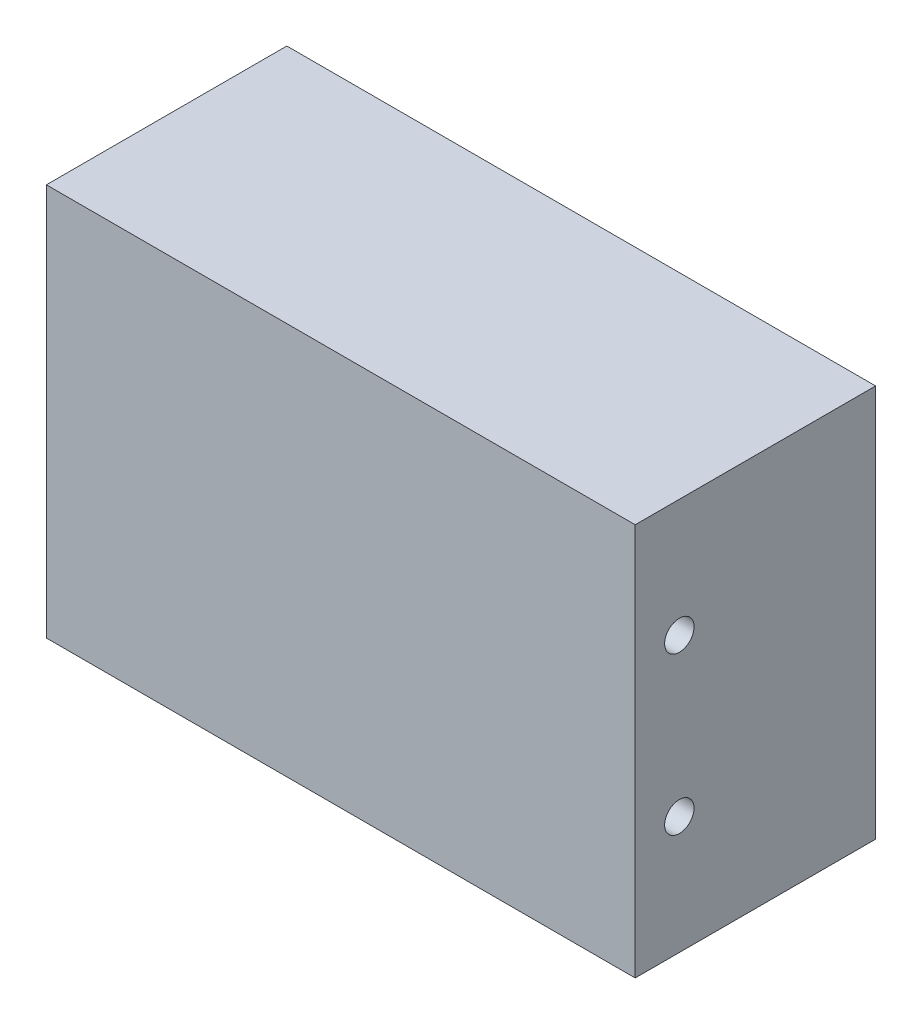
ISO-10303-21;
HEADER;
FILE_DESCRIPTION(('STEP AP214'),'2;1');
FILE_NAME('part.step','',(''),(''),'','','');
FILE_SCHEMA(('AUTOMOTIVE_DESIGN { 1 0 10303 214 1 1 1 1 }'));
ENDSEC;
DATA;
#1=APPLICATION_CONTEXT('core data for automotive mechanical design processes');
#2=APPLICATION_PROTOCOL_DEFINITION('international standard','automotive_design',2000,#1);
#3=PRODUCT_CONTEXT('',#1,'mechanical');
#4=PRODUCT('Part','Part','',(#3));
#5=PRODUCT_RELATED_PRODUCT_CATEGORY('part','',(#4));
#6=PRODUCT_DEFINITION_FORMATION('','',#4);
#7=PRODUCT_DEFINITION_CONTEXT('part definition',#1,'design');
#8=PRODUCT_DEFINITION('design','',#6,#7);
#9=PRODUCT_DEFINITION_SHAPE('','',#8);
#10=(LENGTH_UNIT() NAMED_UNIT(*) SI_UNIT(.MILLI.,.METRE.));
#11=(NAMED_UNIT(*) PLANE_ANGLE_UNIT() SI_UNIT($,.RADIAN.));
#12=(NAMED_UNIT(*) SI_UNIT($,.STERADIAN.) SOLID_ANGLE_UNIT());
#13=UNCERTAINTY_MEASURE_WITH_UNIT(LENGTH_MEASURE(1.E-05),#10,'distance_accuracy_value','');
#14=(GEOMETRIC_REPRESENTATION_CONTEXT(3) GLOBAL_UNCERTAINTY_ASSIGNED_CONTEXT((#13)) GLOBAL_UNIT_ASSIGNED_CONTEXT((#10,
#11,#12)) REPRESENTATION_CONTEXT('',''));
#15=CARTESIAN_POINT('',(0.,0.,0.));
#16=DIRECTION('',(0.,0.,1.));
#17=DIRECTION('',(1.,0.,0.));
#18=AXIS2_PLACEMENT_3D('',#15,#16,#17);
#19=CARTESIAN_POINT('',(30.,40.,12.25));
#20=DIRECTION('',(-1.,0.,0.));
#21=DIRECTION('',(0.,0.,1.));
#22=AXIS2_PLACEMENT_3D('',#19,#20,#21);
#23=PLANE('',#22);
#24=CARTESIAN_POINT('',(30.,28.,7.75000000000001));
#25=DIRECTION('',(1.,0.,0.));
#26=DIRECTION('',(0.,0.,-1.));
#27=AXIS2_PLACEMENT_3D('',#24,#25,#26);
#28=CIRCLE('',#27,1.5);
#29=CARTESIAN_POINT('',(30.,28.,6.25000000000001));
#30=VERTEX_POINT('',#29);
#31=EDGE_CURVE('E130',#30,#30,#28,.T.);
#32=ORIENTED_EDGE('',*,*,#31,.F.);
#33=EDGE_LOOP('',(#32));
#34=FACE_BOUND('',#33,.T.);
#35=CARTESIAN_POINT('',(30.,12.,7.75));
#36=DIRECTION('',(1.,0.,0.));
#37=DIRECTION('',(0.,0.,-1.));
#38=AXIS2_PLACEMENT_3D('',#35,#36,#37);
#39=CIRCLE('',#38,1.5);
#40=CARTESIAN_POINT('',(30.,12.,6.25));
#41=VERTEX_POINT('',#40);
#42=EDGE_CURVE('E124',#41,#41,#39,.T.);
#43=ORIENTED_EDGE('',*,*,#42,.F.);
#44=EDGE_LOOP('',(#43));
#45=FACE_BOUND('',#44,.T.);
#46=DIRECTION('',(0.,0.,-1.));
#47=VECTOR('',#46,1.);
#48=CARTESIAN_POINT('',(30.,0.,12.25));
#49=LINE('',#48,#47);
#50=CARTESIAN_POINT('',(30.,0.,12.25));
#51=VERTEX_POINT('',#50);
#52=CARTESIAN_POINT('',(30.,0.,-12.25));
#53=VERTEX_POINT('',#52);
#54=EDGE_CURVE('E98',#51,#53,#49,.T.);
#55=ORIENTED_EDGE('',*,*,#54,.T.);
#56=DIRECTION('',(0.,-1.,0.));
#57=VECTOR('',#56,1.);
#58=CARTESIAN_POINT('',(30.,40.,-12.25));
#59=LINE('',#58,#57);
#60=CARTESIAN_POINT('',(30.,40.,-12.25));
#61=VERTEX_POINT('',#60);
#62=EDGE_CURVE('E11',#61,#53,#59,.T.);
#63=ORIENTED_EDGE('',*,*,#62,.F.);
#64=DIRECTION('',(0.,0.,-1.));
#65=VECTOR('',#64,1.);
#66=CARTESIAN_POINT('',(30.,40.,12.25));
#67=LINE('',#66,#65);
#68=CARTESIAN_POINT('',(30.,40.,12.25));
#69=VERTEX_POINT('',#68);
#70=EDGE_CURVE('E86',#69,#61,#67,.T.);
#71=ORIENTED_EDGE('',*,*,#70,.F.);
#72=DIRECTION('',(0.,-1.,0.));
#73=VECTOR('',#72,1.);
#74=CARTESIAN_POINT('',(30.,40.,12.25));
#75=LINE('',#74,#73);
#76=EDGE_CURVE('E94',#69,#51,#75,.T.);
#77=ORIENTED_EDGE('',*,*,#76,.T.);
#78=EDGE_LOOP('',(#55,#63,#71,#77));
#79=FACE_BOUND('',#78,.T.);
#80=ADVANCED_FACE('F35',(#34,#45,#79),#23,.F.);
#81=CARTESIAN_POINT('',(-30.,40.,-12.25));
#82=DIRECTION('',(0.,0.,1.));
#83=DIRECTION('',(1.,0.,0.));
#84=AXIS2_PLACEMENT_3D('',#81,#82,#83);
#85=PLANE('',#84);
#86=DIRECTION('',(-1.,0.,0.));
#87=VECTOR('',#86,1.);
#88=CARTESIAN_POINT('',(-30.,0.,-12.25));
#89=LINE('',#88,#87);
#90=CARTESIAN_POINT('',(-30.,0.,-12.25));
#91=VERTEX_POINT('',#90);
#92=EDGE_CURVE('E90',#53,#91,#89,.T.);
#93=ORIENTED_EDGE('',*,*,#92,.T.);
#94=DIRECTION('',(0.,-1.,0.));
#95=VECTOR('',#94,1.);
#96=CARTESIAN_POINT('',(-30.,40.,-12.25));
#97=LINE('',#96,#95);
#98=CARTESIAN_POINT('',(-30.,40.,-12.25));
#99=VERTEX_POINT('',#98);
#100=EDGE_CURVE('E43',#99,#91,#97,.T.);
#101=ORIENTED_EDGE('',*,*,#100,.F.);
#102=DIRECTION('',(-1.,0.,0.));
#103=VECTOR('',#102,1.);
#104=CARTESIAN_POINT('',(-30.,40.,-12.25));
#105=LINE('',#104,#103);
#106=EDGE_CURVE('E81',#61,#99,#105,.T.);
#107=ORIENTED_EDGE('',*,*,#106,.F.);
#108=ORIENTED_EDGE('',*,*,#62,.T.);
#109=EDGE_LOOP('',(#93,#101,#107,#108));
#110=FACE_BOUND('',#109,.T.);
#111=ADVANCED_FACE('F89',(#110),#85,.F.);
#112=CARTESIAN_POINT('',(-30.,40.,12.25));
#113=DIRECTION('',(1.,0.,0.));
#114=DIRECTION('',(0.,0.,-1.));
#115=AXIS2_PLACEMENT_3D('',#112,#113,#114);
#116=PLANE('',#115);
#117=DIRECTION('',(0.,0.,1.));
#118=VECTOR('',#117,1.);
#119=CARTESIAN_POINT('',(-30.,0.,12.25));
#120=LINE('',#119,#118);
#121=CARTESIAN_POINT('',(-30.,0.,12.25));
#122=VERTEX_POINT('',#121);
#123=EDGE_CURVE('E68',#91,#122,#120,.T.);
#124=ORIENTED_EDGE('',*,*,#123,.T.);
#125=DIRECTION('',(0.,-1.,0.));
#126=VECTOR('',#125,1.);
#127=CARTESIAN_POINT('',(-30.,40.,12.25));
#128=LINE('',#127,#126);
#129=CARTESIAN_POINT('',(-30.,40.,12.25));
#130=VERTEX_POINT('',#129);
#131=EDGE_CURVE('E91',#130,#122,#128,.T.);
#132=ORIENTED_EDGE('',*,*,#131,.F.);
#133=DIRECTION('',(0.,0.,1.));
#134=VECTOR('',#133,1.);
#135=CARTESIAN_POINT('',(-30.,40.,12.25));
#136=LINE('',#135,#134);
#137=EDGE_CURVE('E84',#99,#130,#136,.T.);
#138=ORIENTED_EDGE('',*,*,#137,.F.);
#139=ORIENTED_EDGE('',*,*,#100,.T.);
#140=EDGE_LOOP('',(#124,#132,#138,#139));
#141=FACE_BOUND('',#140,.T.);
#142=ADVANCED_FACE('F92',(#141),#116,.F.);
#143=CARTESIAN_POINT('',(-30.,40.,12.25));
#144=DIRECTION('',(0.,0.,-1.));
#145=DIRECTION('',(-1.,0.,0.));
#146=AXIS2_PLACEMENT_3D('',#143,#144,#145);
#147=PLANE('',#146);
#148=DIRECTION('',(1.,0.,0.));
#149=VECTOR('',#148,1.);
#150=CARTESIAN_POINT('',(-30.,0.,12.25));
#151=LINE('',#150,#149);
#152=EDGE_CURVE('E74',#122,#51,#151,.T.);
#153=ORIENTED_EDGE('',*,*,#152,.T.);
#154=ORIENTED_EDGE('',*,*,#76,.F.);
#155=DIRECTION('',(1.,0.,0.));
#156=VECTOR('',#155,1.);
#157=CARTESIAN_POINT('',(-30.,40.,12.25));
#158=LINE('',#157,#156);
#159=EDGE_CURVE('E51',#130,#69,#158,.T.);
#160=ORIENTED_EDGE('',*,*,#159,.F.);
#161=ORIENTED_EDGE('',*,*,#131,.T.);
#162=EDGE_LOOP('',(#153,#154,#160,#161));
#163=FACE_BOUND('',#162,.T.);
#164=ADVANCED_FACE('F106',(#163),#147,.F.);
#165=CARTESIAN_POINT('',(0.,40.,0.));
#166=DIRECTION('',(0.,-1.,0.));
#167=DIRECTION('',(0.,0.,-1.));
#168=AXIS2_PLACEMENT_3D('',#165,#166,#167);
#169=PLANE('',#168);
#170=ORIENTED_EDGE('',*,*,#70,.T.);
#171=ORIENTED_EDGE('',*,*,#106,.T.);
#172=ORIENTED_EDGE('',*,*,#137,.T.);
#173=ORIENTED_EDGE('',*,*,#159,.T.);
#174=EDGE_LOOP('',(#170,#171,#172,#173));
#175=FACE_BOUND('',#174,.T.);
#176=ADVANCED_FACE('F82',(#175),#169,.F.);
#177=CARTESIAN_POINT('',(0.,0.,0.));
#178=DIRECTION('',(0.,-1.,0.));
#179=DIRECTION('',(0.,0.,-1.));
#180=AXIS2_PLACEMENT_3D('',#177,#178,#179);
#181=PLANE('',#180);
#182=CARTESIAN_POINT('',(-8.,0.,7.75));
#183=DIRECTION('',(0.,-1.,0.));
#184=DIRECTION('',(0.,0.,-1.));
#185=AXIS2_PLACEMENT_3D('',#182,#183,#184);
#186=CIRCLE('',#185,1.5);
#187=CARTESIAN_POINT('',(-8.,0.,6.25));
#188=VERTEX_POINT('',#187);
#189=EDGE_CURVE('E119',#188,#188,#186,.T.);
#190=ORIENTED_EDGE('',*,*,#189,.F.);
#191=EDGE_LOOP('',(#190));
#192=FACE_BOUND('',#191,.T.);
#193=CARTESIAN_POINT('',(8.,0.,7.75));
#194=DIRECTION('',(0.,-1.,0.));
#195=DIRECTION('',(0.,0.,-1.));
#196=AXIS2_PLACEMENT_3D('',#193,#194,#195);
#197=CIRCLE('',#196,1.5);
#198=CARTESIAN_POINT('',(8.,0.,6.25));
#199=VERTEX_POINT('',#198);
#200=EDGE_CURVE('E112',#199,#199,#197,.T.);
#201=ORIENTED_EDGE('',*,*,#200,.F.);
#202=EDGE_LOOP('',(#201));
#203=FACE_BOUND('',#202,.T.);
#204=ORIENTED_EDGE('',*,*,#54,.F.);
#205=ORIENTED_EDGE('',*,*,#152,.F.);
#206=ORIENTED_EDGE('',*,*,#123,.F.);
#207=ORIENTED_EDGE('',*,*,#92,.F.);
#208=EDGE_LOOP('',(#204,#205,#206,#207));
#209=FACE_BOUND('',#208,.T.);
#210=ADVANCED_FACE('F109',(#192,#203,#209),#181,.T.);
#211=CARTESIAN_POINT('',(8.,0.5,7.75));
#212=DIRECTION('',(0.,-1.,0.));
#213=DIRECTION('',(0.,0.,-1.));
#214=AXIS2_PLACEMENT_3D('',#211,#212,#213);
#215=CYLINDRICAL_SURFACE('',#214,1.5);
#216=CARTESIAN_POINT('',(8.,0.5,7.75));
#217=DIRECTION('',(0.,-1.,0.));
#218=DIRECTION('',(0.,0.,-1.));
#219=AXIS2_PLACEMENT_3D('',#216,#217,#218);
#220=CIRCLE('',#219,1.5);
#221=CARTESIAN_POINT('',(8.,0.5,6.25));
#222=VERTEX_POINT('',#221);
#223=EDGE_CURVE('E115',#222,#222,#220,.T.);
#224=ORIENTED_EDGE('',*,*,#223,.F.);
#225=EDGE_LOOP('',(#224));
#226=FACE_BOUND('',#225,.T.);
#227=ORIENTED_EDGE('',*,*,#200,.T.);
#228=EDGE_LOOP('',(#227));
#229=FACE_BOUND('',#228,.T.);
#230=ADVANCED_FACE('F171',(#226,#229),#215,.F.);
#231=CARTESIAN_POINT('',(8.,0.5,7.75));
#232=DIRECTION('',(0.,-1.,0.));
#233=DIRECTION('',(0.,0.,-1.));
#234=AXIS2_PLACEMENT_3D('',#231,#232,#233);
#235=PLANE('',#234);
#236=ORIENTED_EDGE('',*,*,#223,.T.);
#237=EDGE_LOOP('',(#236));
#238=FACE_BOUND('',#237,.T.);
#239=ADVANCED_FACE('F167',(#238),#235,.T.);
#240=CARTESIAN_POINT('',(-8.,0.5,7.75));
#241=DIRECTION('',(0.,-1.,0.));
#242=DIRECTION('',(0.,0.,-1.));
#243=AXIS2_PLACEMENT_3D('',#240,#241,#242);
#244=CYLINDRICAL_SURFACE('',#243,1.5);
#245=CARTESIAN_POINT('',(-8.,0.5,7.75));
#246=DIRECTION('',(0.,-1.,0.));
#247=DIRECTION('',(0.,0.,-1.));
#248=AXIS2_PLACEMENT_3D('',#245,#246,#247);
#249=CIRCLE('',#248,1.5);
#250=CARTESIAN_POINT('',(-8.,0.5,6.25));
#251=VERTEX_POINT('',#250);
#252=EDGE_CURVE('E101',#251,#251,#249,.T.);
#253=ORIENTED_EDGE('',*,*,#252,.F.);
#254=EDGE_LOOP('',(#253));
#255=FACE_BOUND('',#254,.T.);
#256=ORIENTED_EDGE('',*,*,#189,.T.);
#257=EDGE_LOOP('',(#256));
#258=FACE_BOUND('',#257,.T.);
#259=ADVANCED_FACE('F160',(#255,#258),#244,.F.);
#260=CARTESIAN_POINT('',(-8.,0.5,7.75));
#261=DIRECTION('',(0.,-1.,0.));
#262=DIRECTION('',(0.,0.,-1.));
#263=AXIS2_PLACEMENT_3D('',#260,#261,#262);
#264=PLANE('',#263);
#265=ORIENTED_EDGE('',*,*,#252,.T.);
#266=EDGE_LOOP('',(#265));
#267=FACE_BOUND('',#266,.T.);
#268=ADVANCED_FACE('F151',(#267),#264,.T.);
#269=CARTESIAN_POINT('',(27.,12.,7.75));
#270=DIRECTION('',(1.,0.,0.));
#271=DIRECTION('',(0.,0.,-1.));
#272=AXIS2_PLACEMENT_3D('',#269,#270,#271);
#273=CYLINDRICAL_SURFACE('',#272,1.5);
#274=CARTESIAN_POINT('',(27.,12.,7.75));
#275=DIRECTION('',(1.,0.,0.));
#276=DIRECTION('',(0.,0.,-1.));
#277=AXIS2_PLACEMENT_3D('',#274,#275,#276);
#278=CIRCLE('',#277,1.5);
#279=CARTESIAN_POINT('',(27.,12.,6.25));
#280=VERTEX_POINT('',#279);
#281=EDGE_CURVE('E127',#280,#280,#278,.T.);
#282=ORIENTED_EDGE('',*,*,#281,.F.);
#283=EDGE_LOOP('',(#282));
#284=FACE_BOUND('',#283,.T.);
#285=ORIENTED_EDGE('',*,*,#42,.T.);
#286=EDGE_LOOP('',(#285));
#287=FACE_BOUND('',#286,.T.);
#288=ADVANCED_FACE('F149',(#284,#287),#273,.F.);
#289=CARTESIAN_POINT('',(27.,12.,7.75));
#290=DIRECTION('',(1.,0.,0.));
#291=DIRECTION('',(0.,0.,-1.));
#292=AXIS2_PLACEMENT_3D('',#289,#290,#291);
#293=PLANE('',#292);
#294=ORIENTED_EDGE('',*,*,#281,.T.);
#295=EDGE_LOOP('',(#294));
#296=FACE_BOUND('',#295,.T.);
#297=ADVANCED_FACE('F141',(#296),#293,.T.);
#298=CARTESIAN_POINT('',(27.,28.,7.75000000000001));
#299=DIRECTION('',(1.,0.,0.));
#300=DIRECTION('',(0.,0.,-1.));
#301=AXIS2_PLACEMENT_3D('',#298,#299,#300);
#302=CYLINDRICAL_SURFACE('',#301,1.5);
#303=CARTESIAN_POINT('',(27.,28.,7.75000000000001));
#304=DIRECTION('',(1.,0.,0.));
#305=DIRECTION('',(0.,0.,-1.));
#306=AXIS2_PLACEMENT_3D('',#303,#304,#305);
#307=CIRCLE('',#306,1.5);
#308=CARTESIAN_POINT('',(27.,28.,6.25000000000001));
#309=VERTEX_POINT('',#308);
#310=EDGE_CURVE('E116',#309,#309,#307,.T.);
#311=ORIENTED_EDGE('',*,*,#310,.F.);
#312=EDGE_LOOP('',(#311));
#313=FACE_BOUND('',#312,.T.);
#314=ORIENTED_EDGE('',*,*,#31,.T.);
#315=EDGE_LOOP('',(#314));
#316=FACE_BOUND('',#315,.T.);
#317=ADVANCED_FACE('F138',(#313,#316),#302,.F.);
#318=CARTESIAN_POINT('',(27.,28.,7.75000000000001));
#319=DIRECTION('',(1.,0.,0.));
#320=DIRECTION('',(0.,0.,-1.));
#321=AXIS2_PLACEMENT_3D('',#318,#319,#320);
#322=PLANE('',#321);
#323=ORIENTED_EDGE('',*,*,#310,.T.);
#324=EDGE_LOOP('',(#323));
#325=FACE_BOUND('',#324,.T.);
#326=ADVANCED_FACE('F136',(#325),#322,.T.);
#327=CLOSED_SHELL('',(#80,#111,#142,#164,#176,#210,#230,#239,#259,#268,#288,#297,#317,#326));
#328=MANIFOLD_SOLID_BREP('B2',#327);
#329=ADVANCED_BREP_SHAPE_REPRESENTATION('',(#18,#328),#14);
#330=SHAPE_DEFINITION_REPRESENTATION(#9,#329);
ENDSEC;
END-ISO-10303-21;
